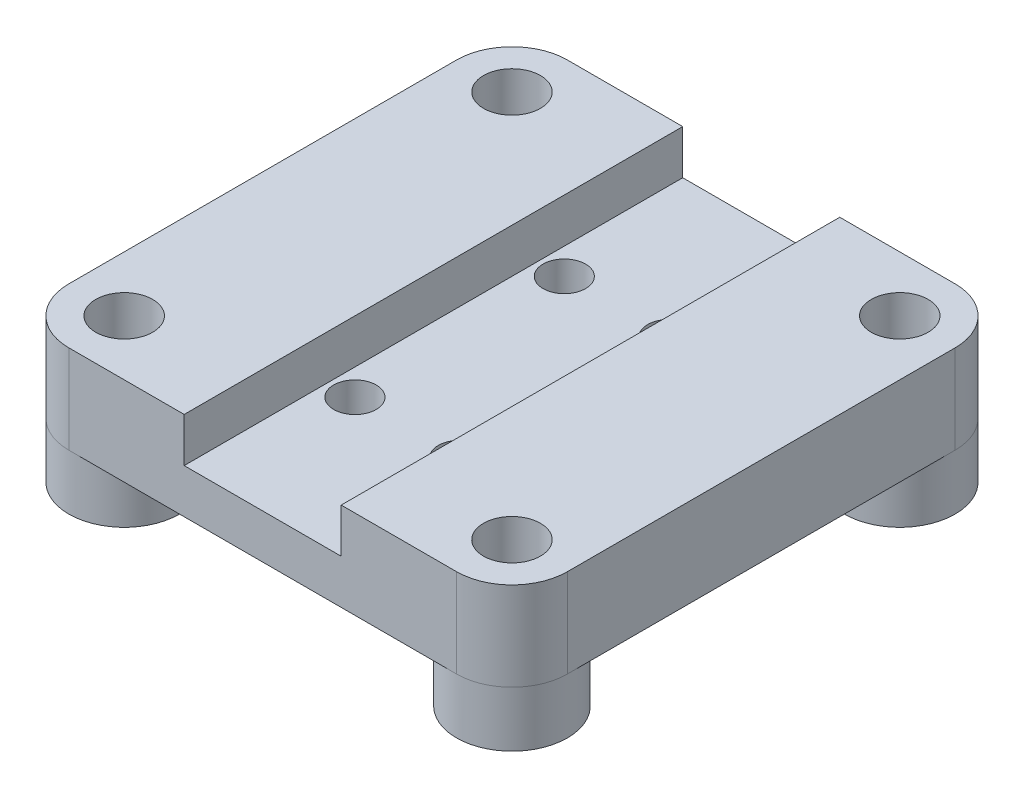
ISO-10303-21;
HEADER;
FILE_DESCRIPTION(('STEP AP214'),'2;1');
FILE_NAME('part.step','',(''),(''),'','','');
FILE_SCHEMA(('AUTOMOTIVE_DESIGN { 1 0 10303 214 1 1 1 1 }'));
ENDSEC;
DATA;
#1=APPLICATION_CONTEXT('core data for automotive mechanical design processes');
#2=APPLICATION_PROTOCOL_DEFINITION('international standard','automotive_design',2000,#1);
#3=PRODUCT_CONTEXT('',#1,'mechanical');
#4=PRODUCT('Part','Part','',(#3));
#5=PRODUCT_RELATED_PRODUCT_CATEGORY('part','',(#4));
#6=PRODUCT_DEFINITION_FORMATION('','',#4);
#7=PRODUCT_DEFINITION_CONTEXT('part definition',#1,'design');
#8=PRODUCT_DEFINITION('design','',#6,#7);
#9=PRODUCT_DEFINITION_SHAPE('','',#8);
#10=(LENGTH_UNIT() NAMED_UNIT(*) SI_UNIT(.MILLI.,.METRE.));
#11=(NAMED_UNIT(*) PLANE_ANGLE_UNIT() SI_UNIT($,.RADIAN.));
#12=(NAMED_UNIT(*) SI_UNIT($,.STERADIAN.) SOLID_ANGLE_UNIT());
#13=UNCERTAINTY_MEASURE_WITH_UNIT(LENGTH_MEASURE(1.E-05),#10,'distance_accuracy_value','');
#14=(GEOMETRIC_REPRESENTATION_CONTEXT(3) GLOBAL_UNCERTAINTY_ASSIGNED_CONTEXT((#13)) GLOBAL_UNIT_ASSIGNED_CONTEXT((#10,
#11,#12)) REPRESENTATION_CONTEXT('',''));
#15=CARTESIAN_POINT('',(0.,0.,0.));
#16=DIRECTION('',(0.,0.,1.));
#17=DIRECTION('',(1.,0.,0.));
#18=AXIS2_PLACEMENT_3D('',#15,#16,#17);
#19=CARTESIAN_POINT('',(14.2875,0.,14.2875));
#20=DIRECTION('',(0.,1.,0.));
#21=DIRECTION('',(-1.,0.,0.));
#22=AXIS2_PLACEMENT_3D('',#19,#20,#21);
#23=PLANE('',#22);
#24=CARTESIAN_POINT('',(-2.999999969,0.,-5.999999938));
#25=DIRECTION('',(0.,1.,0.));
#26=DIRECTION('',(-1.,0.,0.));
#27=AXIS2_PLACEMENT_3D('',#24,#25,#26);
#28=CIRCLE('',#27,1.2192);
#29=CARTESIAN_POINT('',(-4.219199969,0.,-5.999999938));
#30=VERTEX_POINT('',#29);
#31=EDGE_CURVE('E282',#30,#30,#28,.T.);
#32=ORIENTED_EDGE('',*,*,#31,.T.);
#33=EDGE_LOOP('',(#32));
#34=FACE_BOUND('',#33,.T.);
#35=CARTESIAN_POINT('',(2.999999969,0.,5.999999938));
#36=DIRECTION('',(0.,1.,0.));
#37=DIRECTION('',(-1.,0.,0.));
#38=AXIS2_PLACEMENT_3D('',#35,#36,#37);
#39=CIRCLE('',#38,1.2192);
#40=CARTESIAN_POINT('',(1.780799969,0.,5.999999938));
#41=VERTEX_POINT('',#40);
#42=EDGE_CURVE('E37',#41,#41,#39,.T.);
#43=ORIENTED_EDGE('',*,*,#42,.T.);
#44=EDGE_LOOP('',(#43));
#45=FACE_BOUND('',#44,.T.);
#46=CARTESIAN_POINT('',(2.999999969,0.,-5.999999938));
#47=DIRECTION('',(0.,1.,0.));
#48=DIRECTION('',(-1.,0.,0.));
#49=AXIS2_PLACEMENT_3D('',#46,#47,#48);
#50=CIRCLE('',#49,1.2192);
#51=CARTESIAN_POINT('',(1.780799969,0.,-5.999999938));
#52=VERTEX_POINT('',#51);
#53=EDGE_CURVE('E266',#52,#52,#50,.T.);
#54=ORIENTED_EDGE('',*,*,#53,.T.);
#55=EDGE_LOOP('',(#54));
#56=FACE_BOUND('',#55,.T.);
#57=CARTESIAN_POINT('',(-2.999999969,0.,5.999999938));
#58=DIRECTION('',(0.,1.,0.));
#59=DIRECTION('',(-1.,0.,0.));
#60=AXIS2_PLACEMENT_3D('',#57,#58,#59);
#61=CIRCLE('',#60,1.2192);
#62=CARTESIAN_POINT('',(-4.219199969,0.,5.999999938));
#63=VERTEX_POINT('',#62);
#64=EDGE_CURVE('E158',#63,#63,#61,.T.);
#65=ORIENTED_EDGE('',*,*,#64,.T.);
#66=EDGE_LOOP('',(#65));
#67=FACE_BOUND('',#66,.T.);
#68=CARTESIAN_POINT('',(-11.1125,0.,-11.1125));
#69=DIRECTION('',(0.,-1.,0.));
#70=DIRECTION('',(1.,0.,0.));
#71=AXIS2_PLACEMENT_3D('',#68,#69,#70);
#72=CIRCLE('',#71,3.175);
#73=CARTESIAN_POINT('',(-11.1125,0.,-14.2875));
#74=VERTEX_POINT('',#73);
#75=CARTESIAN_POINT('',(-14.2875,0.,-11.1125));
#76=VERTEX_POINT('',#75);
#77=EDGE_CURVE('E133',#74,#76,#72,.T.);
#78=ORIENTED_EDGE('',*,*,#77,.F.);
#79=DIRECTION('',(1.,0.,0.));
#80=VECTOR('',#79,1.);
#81=CARTESIAN_POINT('',(14.2875,0.,-14.2875));
#82=LINE('',#81,#80);
#83=CARTESIAN_POINT('',(11.1125,0.,-14.2875));
#84=VERTEX_POINT('',#83);
#85=EDGE_CURVE('E202',#74,#84,#82,.T.);
#86=ORIENTED_EDGE('',*,*,#85,.T.);
#87=CARTESIAN_POINT('',(11.1125,0.,-11.1125));
#88=DIRECTION('',(0.,-1.,0.));
#89=DIRECTION('',(1.,0.,0.));
#90=AXIS2_PLACEMENT_3D('',#87,#88,#89);
#91=CIRCLE('',#90,3.175);
#92=CARTESIAN_POINT('',(14.2875,0.,-11.1125));
#93=VERTEX_POINT('',#92);
#94=EDGE_CURVE('E170',#93,#84,#91,.T.);
#95=ORIENTED_EDGE('',*,*,#94,.F.);
#96=DIRECTION('',(0.,0.,-1.));
#97=VECTOR('',#96,1.);
#98=CARTESIAN_POINT('',(14.2875,0.,14.2875));
#99=LINE('',#98,#97);
#100=CARTESIAN_POINT('',(14.2875,0.,11.1125));
#101=VERTEX_POINT('',#100);
#102=EDGE_CURVE('E243',#101,#93,#99,.T.);
#103=ORIENTED_EDGE('',*,*,#102,.F.);
#104=CARTESIAN_POINT('',(11.1125,0.,11.1125));
#105=DIRECTION('',(0.,-1.,0.));
#106=DIRECTION('',(1.,0.,0.));
#107=AXIS2_PLACEMENT_3D('',#104,#105,#106);
#108=CIRCLE('',#107,3.175);
#109=CARTESIAN_POINT('',(11.1125,0.,14.2875));
#110=VERTEX_POINT('',#109);
#111=EDGE_CURVE('E175',#110,#101,#108,.T.);
#112=ORIENTED_EDGE('',*,*,#111,.F.);
#113=DIRECTION('',(1.,0.,0.));
#114=VECTOR('',#113,1.);
#115=CARTESIAN_POINT('',(14.2875,0.,14.2875));
#116=LINE('',#115,#114);
#117=CARTESIAN_POINT('',(-11.1125,0.,14.2875));
#118=VERTEX_POINT('',#117);
#119=EDGE_CURVE('E203',#118,#110,#116,.T.);
#120=ORIENTED_EDGE('',*,*,#119,.F.);
#121=CARTESIAN_POINT('',(-11.1125,0.,11.1125));
#122=DIRECTION('',(0.,-1.,0.));
#123=DIRECTION('',(1.,0.,0.));
#124=AXIS2_PLACEMENT_3D('',#121,#122,#123);
#125=CIRCLE('',#124,3.175);
#126=CARTESIAN_POINT('',(-14.2875,0.,11.1125));
#127=VERTEX_POINT('',#126);
#128=EDGE_CURVE('E152',#127,#118,#125,.T.);
#129=ORIENTED_EDGE('',*,*,#128,.F.);
#130=DIRECTION('',(0.,0.,-1.));
#131=VECTOR('',#130,1.);
#132=CARTESIAN_POINT('',(-14.2875,0.,14.2875));
#133=LINE('',#132,#131);
#134=EDGE_CURVE('E140',#127,#76,#133,.T.);
#135=ORIENTED_EDGE('',*,*,#134,.T.);
#136=EDGE_LOOP('',(#78,#86,#95,#103,#112,#120,#129,#135));
#137=FACE_BOUND('',#136,.T.);
#138=ADVANCED_FACE('F33',(#34,#45,#56,#67,#137),#23,.F.);
#139=CARTESIAN_POINT('',(14.2875,5.08,14.2875));
#140=DIRECTION('',(-1.,0.,0.));
#141=DIRECTION('',(0.,0.,1.));
#142=AXIS2_PLACEMENT_3D('',#139,#140,#141);
#143=PLANE('',#142);
#144=ORIENTED_EDGE('',*,*,#102,.T.);
#145=DIRECTION('',(0.,1.,0.));
#146=VECTOR('',#145,1.);
#147=CARTESIAN_POINT('',(14.2875,5.08,-11.1125));
#148=LINE('',#147,#146);
#149=CARTESIAN_POINT('',(14.2875,5.08,-11.1125));
#150=VERTEX_POINT('',#149);
#151=EDGE_CURVE('E261',#93,#150,#148,.T.);
#152=ORIENTED_EDGE('',*,*,#151,.T.);
#153=DIRECTION('',(0.,0.,-1.));
#154=VECTOR('',#153,1.);
#155=CARTESIAN_POINT('',(14.2875,5.08,14.2875));
#156=LINE('',#155,#154);
#157=CARTESIAN_POINT('',(14.2875,5.08,11.1125));
#158=VERTEX_POINT('',#157);
#159=EDGE_CURVE('E241',#158,#150,#156,.T.);
#160=ORIENTED_EDGE('',*,*,#159,.F.);
#161=DIRECTION('',(0.,1.,0.));
#162=VECTOR('',#161,1.);
#163=CARTESIAN_POINT('',(14.2875,5.08,11.1125));
#164=LINE('',#163,#162);
#165=EDGE_CURVE('E259',#158,#101,#164,.F.);
#166=ORIENTED_EDGE('',*,*,#165,.T.);
#167=EDGE_LOOP('',(#144,#152,#160,#166));
#168=FACE_BOUND('',#167,.T.);
#169=ADVANCED_FACE('F345',(#168),#143,.F.);
#170=CARTESIAN_POINT('',(4.5,5.08,14.2875));
#171=DIRECTION('',(0.,-1.,0.));
#172=DIRECTION('',(0.,0.,-1.));
#173=AXIS2_PLACEMENT_3D('',#170,#171,#172);
#174=PLANE('',#173);
#175=CARTESIAN_POINT('',(11.1125,5.08,11.1125));
#176=DIRECTION('',(0.,1.,0.));
#177=DIRECTION('',(0.,0.,1.));
#178=AXIS2_PLACEMENT_3D('',#175,#176,#177);
#179=CIRCLE('',#178,1.63195);
#180=CARTESIAN_POINT('',(11.1125,5.08,12.74445));
#181=VERTEX_POINT('',#180);
#182=EDGE_CURVE('E193',#181,#181,#179,.T.);
#183=ORIENTED_EDGE('',*,*,#182,.F.);
#184=EDGE_LOOP('',(#183));
#185=FACE_BOUND('',#184,.T.);
#186=CARTESIAN_POINT('',(11.1125,5.08,-11.1125));
#187=DIRECTION('',(0.,1.,0.));
#188=DIRECTION('',(0.,0.,1.));
#189=AXIS2_PLACEMENT_3D('',#186,#187,#188);
#190=CIRCLE('',#189,1.63195);
#191=CARTESIAN_POINT('',(11.1125,5.08,-9.48055));
#192=VERTEX_POINT('',#191);
#193=EDGE_CURVE('E196',#192,#192,#190,.T.);
#194=ORIENTED_EDGE('',*,*,#193,.F.);
#195=EDGE_LOOP('',(#194));
#196=FACE_BOUND('',#195,.T.);
#197=ORIENTED_EDGE('',*,*,#159,.T.);
#198=CARTESIAN_POINT('',(11.1125,5.08,-11.1125));
#199=DIRECTION('',(0.,-1.,0.));
#200=DIRECTION('',(0.,0.,-1.));
#201=AXIS2_PLACEMENT_3D('',#198,#199,#200);
#202=CIRCLE('',#201,3.175);
#203=CARTESIAN_POINT('',(11.1125,5.08,-14.2875));
#204=VERTEX_POINT('',#203);
#205=EDGE_CURVE('E11',#150,#204,#202,.F.);
#206=ORIENTED_EDGE('',*,*,#205,.T.);
#207=DIRECTION('',(-1.,0.,0.));
#208=VECTOR('',#207,1.);
#209=CARTESIAN_POINT('',(4.5,5.08,-14.2875));
#210=LINE('',#209,#208);
#211=CARTESIAN_POINT('',(4.5,5.08,-14.2875));
#212=VERTEX_POINT('',#211);
#213=EDGE_CURVE('E218',#204,#212,#210,.T.);
#214=ORIENTED_EDGE('',*,*,#213,.T.);
#215=DIRECTION('',(0.,0.,-1.));
#216=VECTOR('',#215,1.);
#217=CARTESIAN_POINT('',(4.5,5.08,14.2875));
#218=LINE('',#217,#216);
#219=CARTESIAN_POINT('',(4.5,5.08,14.2875));
#220=VERTEX_POINT('',#219);
#221=EDGE_CURVE('E238',#220,#212,#218,.T.);
#222=ORIENTED_EDGE('',*,*,#221,.F.);
#223=DIRECTION('',(-1.,0.,0.));
#224=VECTOR('',#223,1.);
#225=CARTESIAN_POINT('',(4.5,5.08,14.2875));
#226=LINE('',#225,#224);
#227=CARTESIAN_POINT('',(11.1125,5.08,14.2875));
#228=VERTEX_POINT('',#227);
#229=EDGE_CURVE('E206',#228,#220,#226,.T.);
#230=ORIENTED_EDGE('',*,*,#229,.F.);
#231=CARTESIAN_POINT('',(11.1125,5.08,11.1125));
#232=DIRECTION('',(0.,-1.,0.));
#233=DIRECTION('',(0.,0.,-1.));
#234=AXIS2_PLACEMENT_3D('',#231,#232,#233);
#235=CIRCLE('',#234,3.175);
#236=EDGE_CURVE('E42',#228,#158,#235,.F.);
#237=ORIENTED_EDGE('',*,*,#236,.T.);
#238=EDGE_LOOP('',(#197,#206,#214,#222,#230,#237));
#239=FACE_BOUND('',#238,.T.);
#240=ADVANCED_FACE('F351',(#185,#196,#239),#174,.F.);
#241=CARTESIAN_POINT('',(4.5,2.54,14.2875));
#242=DIRECTION('',(1.,0.,0.));
#243=DIRECTION('',(0.,0.,-1.));
#244=AXIS2_PLACEMENT_3D('',#241,#242,#243);
#245=PLANE('',#244);
#246=DIRECTION('',(0.,-1.,0.));
#247=VECTOR('',#246,1.);
#248=CARTESIAN_POINT('',(4.5,2.54,-14.2875));
#249=LINE('',#248,#247);
#250=CARTESIAN_POINT('',(4.5,2.54,-14.2875));
#251=VERTEX_POINT('',#250);
#252=EDGE_CURVE('E220',#212,#251,#249,.T.);
#253=ORIENTED_EDGE('',*,*,#252,.T.);
#254=DIRECTION('',(0.,0.,-1.));
#255=VECTOR('',#254,1.);
#256=CARTESIAN_POINT('',(4.5,2.54,14.2875));
#257=LINE('',#256,#255);
#258=CARTESIAN_POINT('',(4.5,2.54,14.2875));
#259=VERTEX_POINT('',#258);
#260=EDGE_CURVE('E235',#259,#251,#257,.T.);
#261=ORIENTED_EDGE('',*,*,#260,.F.);
#262=DIRECTION('',(0.,-1.,0.));
#263=VECTOR('',#262,1.);
#264=CARTESIAN_POINT('',(4.5,2.54,14.2875));
#265=LINE('',#264,#263);
#266=EDGE_CURVE('E209',#220,#259,#265,.T.);
#267=ORIENTED_EDGE('',*,*,#266,.F.);
#268=ORIENTED_EDGE('',*,*,#221,.T.);
#269=EDGE_LOOP('',(#253,#261,#267,#268));
#270=FACE_BOUND('',#269,.T.);
#271=ADVANCED_FACE('F296',(#270),#245,.F.);
#272=CARTESIAN_POINT('',(-4.5,2.54,14.2875));
#273=DIRECTION('',(0.,-1.,0.));
#274=DIRECTION('',(1.,0.,0.));
#275=AXIS2_PLACEMENT_3D('',#272,#273,#274);
#276=PLANE('',#275);
#277=CARTESIAN_POINT('',(-2.999999969,2.54,-5.999999938));
#278=DIRECTION('',(0.,1.,0.));
#279=DIRECTION('',(0.,0.,1.));
#280=AXIS2_PLACEMENT_3D('',#277,#278,#279);
#281=CIRCLE('',#280,1.2192);
#282=CARTESIAN_POINT('',(-2.999999969,2.54,-4.780799938));
#283=VERTEX_POINT('',#282);
#284=EDGE_CURVE('E285',#283,#283,#281,.T.);
#285=ORIENTED_EDGE('',*,*,#284,.F.);
#286=EDGE_LOOP('',(#285));
#287=FACE_BOUND('',#286,.T.);
#288=CARTESIAN_POINT('',(2.999999969,2.54,5.999999938));
#289=DIRECTION('',(0.,1.,0.));
#290=DIRECTION('',(0.,0.,1.));
#291=AXIS2_PLACEMENT_3D('',#288,#289,#290);
#292=CIRCLE('',#291,1.2192);
#293=CARTESIAN_POINT('',(2.999999969,2.54,7.219199938));
#294=VERTEX_POINT('',#293);
#295=EDGE_CURVE('E278',#294,#294,#292,.T.);
#296=ORIENTED_EDGE('',*,*,#295,.F.);
#297=EDGE_LOOP('',(#296));
#298=FACE_BOUND('',#297,.T.);
#299=CARTESIAN_POINT('',(2.999999969,2.54,-5.999999938));
#300=DIRECTION('',(0.,1.,0.));
#301=DIRECTION('',(0.,0.,1.));
#302=AXIS2_PLACEMENT_3D('',#299,#300,#301);
#303=CIRCLE('',#302,1.2192);
#304=CARTESIAN_POINT('',(2.999999969,2.54,-4.780799938));
#305=VERTEX_POINT('',#304);
#306=EDGE_CURVE('E268',#305,#305,#303,.T.);
#307=ORIENTED_EDGE('',*,*,#306,.F.);
#308=EDGE_LOOP('',(#307));
#309=FACE_BOUND('',#308,.T.);
#310=CARTESIAN_POINT('',(-2.999999969,2.54,5.999999938));
#311=DIRECTION('',(0.,1.,0.));
#312=DIRECTION('',(0.,0.,1.));
#313=AXIS2_PLACEMENT_3D('',#310,#311,#312);
#314=CIRCLE('',#313,1.2192);
#315=CARTESIAN_POINT('',(-2.999999969,2.54,7.219199938));
#316=VERTEX_POINT('',#315);
#317=EDGE_CURVE('E265',#316,#316,#314,.T.);
#318=ORIENTED_EDGE('',*,*,#317,.F.);
#319=EDGE_LOOP('',(#318));
#320=FACE_BOUND('',#319,.T.);
#321=DIRECTION('',(-1.,0.,0.));
#322=VECTOR('',#321,1.);
#323=CARTESIAN_POINT('',(-4.5,2.54,-14.2875));
#324=LINE('',#323,#322);
#325=CARTESIAN_POINT('',(-4.5,2.54,-14.2875));
#326=VERTEX_POINT('',#325);
#327=EDGE_CURVE('E222',#251,#326,#324,.T.);
#328=ORIENTED_EDGE('',*,*,#327,.T.);
#329=DIRECTION('',(0.,0.,-1.));
#330=VECTOR('',#329,1.);
#331=CARTESIAN_POINT('',(-4.5,2.54,14.2875));
#332=LINE('',#331,#330);
#333=CARTESIAN_POINT('',(-4.5,2.54,14.2875));
#334=VERTEX_POINT('',#333);
#335=EDGE_CURVE('E232',#334,#326,#332,.T.);
#336=ORIENTED_EDGE('',*,*,#335,.F.);
#337=DIRECTION('',(-1.,0.,0.));
#338=VECTOR('',#337,1.);
#339=CARTESIAN_POINT('',(-4.5,2.54,14.2875));
#340=LINE('',#339,#338);
#341=EDGE_CURVE('E211',#259,#334,#340,.T.);
#342=ORIENTED_EDGE('',*,*,#341,.F.);
#343=ORIENTED_EDGE('',*,*,#260,.T.);
#344=EDGE_LOOP('',(#328,#336,#342,#343));
#345=FACE_BOUND('',#344,.T.);
#346=ADVANCED_FACE('F292',(#287,#298,#309,#320,#345),#276,.F.);
#347=CARTESIAN_POINT('',(-4.5,5.08,14.2875));
#348=DIRECTION('',(-1.,0.,0.));
#349=DIRECTION('',(0.,0.,1.));
#350=AXIS2_PLACEMENT_3D('',#347,#348,#349);
#351=PLANE('',#350);
#352=DIRECTION('',(0.,1.,0.));
#353=VECTOR('',#352,1.);
#354=CARTESIAN_POINT('',(-4.5,5.08,-14.2875));
#355=LINE('',#354,#353);
#356=CARTESIAN_POINT('',(-4.5,5.08,-14.2875));
#357=VERTEX_POINT('',#356);
#358=EDGE_CURVE('E224',#326,#357,#355,.T.);
#359=ORIENTED_EDGE('',*,*,#358,.T.);
#360=DIRECTION('',(0.,0.,-1.));
#361=VECTOR('',#360,1.);
#362=CARTESIAN_POINT('',(-4.5,5.08,14.2875));
#363=LINE('',#362,#361);
#364=CARTESIAN_POINT('',(-4.5,5.08,14.2875));
#365=VERTEX_POINT('',#364);
#366=EDGE_CURVE('E229',#365,#357,#363,.T.);
#367=ORIENTED_EDGE('',*,*,#366,.F.);
#368=DIRECTION('',(0.,1.,0.));
#369=VECTOR('',#368,1.);
#370=CARTESIAN_POINT('',(-4.5,5.08,14.2875));
#371=LINE('',#370,#369);
#372=EDGE_CURVE('E213',#334,#365,#371,.T.);
#373=ORIENTED_EDGE('',*,*,#372,.F.);
#374=ORIENTED_EDGE('',*,*,#335,.T.);
#375=EDGE_LOOP('',(#359,#367,#373,#374));
#376=FACE_BOUND('',#375,.T.);
#377=ADVANCED_FACE('F295',(#376),#351,.F.);
#378=CARTESIAN_POINT('',(-14.2875,5.08,14.2875));
#379=DIRECTION('',(0.,-1.,0.));
#380=DIRECTION('',(1.,0.,0.));
#381=AXIS2_PLACEMENT_3D('',#378,#379,#380);
#382=PLANE('',#381);
#383=CARTESIAN_POINT('',(-11.1125,5.08,-11.1125));
#384=DIRECTION('',(0.,1.,0.));
#385=DIRECTION('',(0.,0.,1.));
#386=AXIS2_PLACEMENT_3D('',#383,#384,#385);
#387=CIRCLE('',#386,1.63195);
#388=CARTESIAN_POINT('',(-11.1125,5.08,-9.48055));
#389=VERTEX_POINT('',#388);
#390=EDGE_CURVE('E189',#389,#389,#387,.T.);
#391=ORIENTED_EDGE('',*,*,#390,.F.);
#392=EDGE_LOOP('',(#391));
#393=FACE_BOUND('',#392,.T.);
#394=CARTESIAN_POINT('',(-11.1125,5.08,11.1125));
#395=DIRECTION('',(0.,1.,0.));
#396=DIRECTION('',(0.,0.,1.));
#397=AXIS2_PLACEMENT_3D('',#394,#395,#396);
#398=CIRCLE('',#397,1.63195);
#399=CARTESIAN_POINT('',(-11.1125,5.08,12.74445));
#400=VERTEX_POINT('',#399);
#401=EDGE_CURVE('E199',#400,#400,#398,.T.);
#402=ORIENTED_EDGE('',*,*,#401,.F.);
#403=EDGE_LOOP('',(#402));
#404=FACE_BOUND('',#403,.T.);
#405=DIRECTION('',(-1.,0.,0.));
#406=VECTOR('',#405,1.);
#407=CARTESIAN_POINT('',(-14.2875,5.08,-14.2875));
#408=LINE('',#407,#406);
#409=CARTESIAN_POINT('',(-11.1125,5.08,-14.2875));
#410=VERTEX_POINT('',#409);
#411=EDGE_CURVE('E207',#357,#410,#408,.T.);
#412=ORIENTED_EDGE('',*,*,#411,.T.);
#413=CARTESIAN_POINT('',(-11.1125,5.08,-11.1125));
#414=DIRECTION('',(0.,-1.,0.));
#415=DIRECTION('',(1.,0.,0.));
#416=AXIS2_PLACEMENT_3D('',#413,#414,#415);
#417=CIRCLE('',#416,3.175);
#418=CARTESIAN_POINT('',(-14.2875,5.08,-11.1125));
#419=VERTEX_POINT('',#418);
#420=EDGE_CURVE('E251',#410,#419,#417,.F.);
#421=ORIENTED_EDGE('',*,*,#420,.T.);
#422=DIRECTION('',(0.,0.,-1.));
#423=VECTOR('',#422,1.);
#424=CARTESIAN_POINT('',(-14.2875,5.08,14.2875));
#425=LINE('',#424,#423);
#426=CARTESIAN_POINT('',(-14.2875,5.08,11.1125));
#427=VERTEX_POINT('',#426);
#428=EDGE_CURVE('E143',#427,#419,#425,.T.);
#429=ORIENTED_EDGE('',*,*,#428,.F.);
#430=CARTESIAN_POINT('',(-11.1125,5.08,11.1125));
#431=DIRECTION('',(0.,-1.,0.));
#432=DIRECTION('',(1.,0.,0.));
#433=AXIS2_PLACEMENT_3D('',#430,#431,#432);
#434=CIRCLE('',#433,3.175);
#435=CARTESIAN_POINT('',(-11.1125,5.08,14.2875));
#436=VERTEX_POINT('',#435);
#437=EDGE_CURVE('E249',#427,#436,#434,.F.);
#438=ORIENTED_EDGE('',*,*,#437,.T.);
#439=DIRECTION('',(-1.,0.,0.));
#440=VECTOR('',#439,1.);
#441=CARTESIAN_POINT('',(-14.2875,5.08,14.2875));
#442=LINE('',#441,#440);
#443=EDGE_CURVE('E153',#365,#436,#442,.T.);
#444=ORIENTED_EDGE('',*,*,#443,.F.);
#445=ORIENTED_EDGE('',*,*,#366,.T.);
#446=EDGE_LOOP('',(#412,#421,#429,#438,#444,#445));
#447=FACE_BOUND('',#446,.T.);
#448=ADVANCED_FACE('F316',(#393,#404,#447),#382,.F.);
#449=CARTESIAN_POINT('',(-14.2875,0.,14.2875));
#450=DIRECTION('',(1.,0.,0.));
#451=DIRECTION('',(0.,1.,0.));
#452=AXIS2_PLACEMENT_3D('',#449,#450,#451);
#453=PLANE('',#452);
#454=ORIENTED_EDGE('',*,*,#428,.T.);
#455=DIRECTION('',(0.,-1.,0.));
#456=VECTOR('',#455,1.);
#457=CARTESIAN_POINT('',(-14.2875,0.,-11.1125));
#458=LINE('',#457,#456);
#459=EDGE_CURVE('E128',#419,#76,#458,.T.);
#460=ORIENTED_EDGE('',*,*,#459,.T.);
#461=ORIENTED_EDGE('',*,*,#134,.F.);
#462=DIRECTION('',(0.,-1.,0.));
#463=VECTOR('',#462,1.);
#464=CARTESIAN_POINT('',(-14.2875,0.,11.1125));
#465=LINE('',#464,#463);
#466=EDGE_CURVE('E145',#127,#427,#465,.F.);
#467=ORIENTED_EDGE('',*,*,#466,.T.);
#468=EDGE_LOOP('',(#454,#460,#461,#467));
#469=FACE_BOUND('',#468,.T.);
#470=ADVANCED_FACE('F139',(#469),#453,.F.);
#471=CARTESIAN_POINT('',(0.,0.,14.2875));
#472=DIRECTION('',(0.,0.,-1.));
#473=DIRECTION('',(-1.,0.,0.));
#474=AXIS2_PLACEMENT_3D('',#471,#472,#473);
#475=PLANE('',#474);
#476=ORIENTED_EDGE('',*,*,#443,.T.);
#477=DIRECTION('',(0.,-1.,0.));
#478=VECTOR('',#477,1.);
#479=CARTESIAN_POINT('',(-11.1125,0.,14.2875));
#480=LINE('',#479,#478);
#481=EDGE_CURVE('E256',#436,#118,#480,.T.);
#482=ORIENTED_EDGE('',*,*,#481,.T.);
#483=ORIENTED_EDGE('',*,*,#119,.T.);
#484=DIRECTION('',(0.,1.,0.));
#485=VECTOR('',#484,1.);
#486=CARTESIAN_POINT('',(11.1125,0.,14.2875));
#487=LINE('',#486,#485);
#488=EDGE_CURVE('E253',#110,#228,#487,.T.);
#489=ORIENTED_EDGE('',*,*,#488,.T.);
#490=ORIENTED_EDGE('',*,*,#229,.T.);
#491=ORIENTED_EDGE('',*,*,#266,.T.);
#492=ORIENTED_EDGE('',*,*,#341,.T.);
#493=ORIENTED_EDGE('',*,*,#372,.T.);
#494=EDGE_LOOP('',(#476,#482,#483,#489,#490,#491,#492,#493));
#495=FACE_BOUND('',#494,.T.);
#496=ADVANCED_FACE('F321',(#495),#475,.F.);
#497=CARTESIAN_POINT('',(0.,0.,-14.2875));
#498=DIRECTION('',(0.,0.,-1.));
#499=DIRECTION('',(-1.,0.,0.));
#500=AXIS2_PLACEMENT_3D('',#497,#498,#499);
#501=PLANE('',#500);
#502=ORIENTED_EDGE('',*,*,#85,.F.);
#503=DIRECTION('',(0.,-1.,0.));
#504=VECTOR('',#503,1.);
#505=CARTESIAN_POINT('',(-11.1125,5.08000000000001,-14.2875));
#506=LINE('',#505,#504);
#507=EDGE_CURVE('E129',#74,#410,#506,.F.);
#508=ORIENTED_EDGE('',*,*,#507,.T.);
#509=ORIENTED_EDGE('',*,*,#411,.F.);
#510=ORIENTED_EDGE('',*,*,#358,.F.);
#511=ORIENTED_EDGE('',*,*,#327,.F.);
#512=ORIENTED_EDGE('',*,*,#252,.F.);
#513=ORIENTED_EDGE('',*,*,#213,.F.);
#514=DIRECTION('',(0.,1.,0.));
#515=VECTOR('',#514,1.);
#516=CARTESIAN_POINT('',(11.1125,0.,-14.2875));
#517=LINE('',#516,#515);
#518=EDGE_CURVE('E144',#204,#84,#517,.F.);
#519=ORIENTED_EDGE('',*,*,#518,.T.);
#520=EDGE_LOOP('',(#502,#508,#509,#510,#511,#512,#513,#519));
#521=FACE_BOUND('',#520,.T.);
#522=ADVANCED_FACE('F314',(#521),#501,.T.);
#523=CARTESIAN_POINT('',(-11.1125,5.08,11.1125));
#524=DIRECTION('',(0.,1.,0.));
#525=DIRECTION('',(0.,0.,1.));
#526=AXIS2_PLACEMENT_3D('',#523,#524,#525);
#527=CYLINDRICAL_SURFACE('',#526,1.63195);
#528=ORIENTED_EDGE('',*,*,#401,.T.);
#529=EDGE_LOOP('',(#528));
#530=FACE_BOUND('',#529,.T.);
#531=CARTESIAN_POINT('',(-11.1125,-3.175,11.1125));
#532=DIRECTION('',(0.,-1.,0.));
#533=DIRECTION('',(1.,0.,0.));
#534=AXIS2_PLACEMENT_3D('',#531,#532,#533);
#535=CIRCLE('',#534,1.63195);
#536=CARTESIAN_POINT('',(-9.48055,-3.175,11.1125));
#537=VERTEX_POINT('',#536);
#538=EDGE_CURVE('E179',#537,#537,#535,.T.);
#539=ORIENTED_EDGE('',*,*,#538,.T.);
#540=EDGE_LOOP('',(#539));
#541=FACE_BOUND('',#540,.T.);
#542=ADVANCED_FACE('F397',(#530,#541),#527,.F.);
#543=CARTESIAN_POINT('',(11.1125,5.08,-11.1125));
#544=DIRECTION('',(0.,1.,0.));
#545=DIRECTION('',(0.,0.,1.));
#546=AXIS2_PLACEMENT_3D('',#543,#544,#545);
#547=CYLINDRICAL_SURFACE('',#546,1.63195);
#548=ORIENTED_EDGE('',*,*,#193,.T.);
#549=EDGE_LOOP('',(#548));
#550=FACE_BOUND('',#549,.T.);
#551=CARTESIAN_POINT('',(11.1125,-3.175,-11.1125));
#552=DIRECTION('',(0.,-1.,0.));
#553=DIRECTION('',(1.,0.,0.));
#554=AXIS2_PLACEMENT_3D('',#551,#552,#553);
#555=CIRCLE('',#554,1.63195);
#556=CARTESIAN_POINT('',(12.74445,-3.175,-11.1125));
#557=VERTEX_POINT('',#556);
#558=EDGE_CURVE('E162',#557,#557,#555,.T.);
#559=ORIENTED_EDGE('',*,*,#558,.T.);
#560=EDGE_LOOP('',(#559));
#561=FACE_BOUND('',#560,.T.);
#562=ADVANCED_FACE('F402',(#550,#561),#547,.F.);
#563=CARTESIAN_POINT('',(11.1125,5.08,11.1125));
#564=DIRECTION('',(0.,1.,0.));
#565=DIRECTION('',(0.,0.,1.));
#566=AXIS2_PLACEMENT_3D('',#563,#564,#565);
#567=CYLINDRICAL_SURFACE('',#566,1.63195);
#568=ORIENTED_EDGE('',*,*,#182,.T.);
#569=EDGE_LOOP('',(#568));
#570=FACE_BOUND('',#569,.T.);
#571=CARTESIAN_POINT('',(11.1125,-3.175,11.1125));
#572=DIRECTION('',(0.,-1.,0.));
#573=DIRECTION('',(1.,0.,0.));
#574=AXIS2_PLACEMENT_3D('',#571,#572,#573);
#575=CIRCLE('',#574,1.63195);
#576=CARTESIAN_POINT('',(12.74445,-3.175,11.1125));
#577=VERTEX_POINT('',#576);
#578=EDGE_CURVE('E169',#577,#577,#575,.T.);
#579=ORIENTED_EDGE('',*,*,#578,.T.);
#580=EDGE_LOOP('',(#579));
#581=FACE_BOUND('',#580,.T.);
#582=ADVANCED_FACE('F406',(#570,#581),#567,.F.);
#583=CARTESIAN_POINT('',(-11.1125,5.08,-11.1125));
#584=DIRECTION('',(0.,1.,0.));
#585=DIRECTION('',(0.,0.,1.));
#586=AXIS2_PLACEMENT_3D('',#583,#584,#585);
#587=CYLINDRICAL_SURFACE('',#586,1.63195);
#588=ORIENTED_EDGE('',*,*,#390,.T.);
#589=EDGE_LOOP('',(#588));
#590=FACE_BOUND('',#589,.T.);
#591=CARTESIAN_POINT('',(-11.1125,-3.175,-11.1125));
#592=DIRECTION('',(0.,-1.,0.));
#593=DIRECTION('',(1.,0.,0.));
#594=AXIS2_PLACEMENT_3D('',#591,#592,#593);
#595=CIRCLE('',#594,1.63195);
#596=CARTESIAN_POINT('',(-9.48055,-3.175,-11.1125));
#597=VERTEX_POINT('',#596);
#598=EDGE_CURVE('E156',#597,#597,#595,.T.);
#599=ORIENTED_EDGE('',*,*,#598,.T.);
#600=EDGE_LOOP('',(#599));
#601=FACE_BOUND('',#600,.T.);
#602=ADVANCED_FACE('F339',(#590,#601),#587,.F.);
#603=CARTESIAN_POINT('',(-11.1125,-3.175,11.1125));
#604=DIRECTION('',(0.,-1.,0.));
#605=DIRECTION('',(1.,0.,0.));
#606=AXIS2_PLACEMENT_3D('',#603,#604,#605);
#607=PLANE('',#606);
#608=CARTESIAN_POINT('',(-11.1125,-3.175,11.1125));
#609=DIRECTION('',(0.,-1.,0.));
#610=DIRECTION('',(1.,0.,0.));
#611=AXIS2_PLACEMENT_3D('',#608,#609,#610);
#612=CIRCLE('',#611,3.175);
#613=CARTESIAN_POINT('',(-7.9375,-3.175,11.1125));
#614=VERTEX_POINT('',#613);
#615=EDGE_CURVE('E186',#614,#614,#612,.T.);
#616=ORIENTED_EDGE('',*,*,#615,.T.);
#617=EDGE_LOOP('',(#616));
#618=FACE_BOUND('',#617,.T.);
#619=ORIENTED_EDGE('',*,*,#538,.F.);
#620=EDGE_LOOP('',(#619));
#621=FACE_BOUND('',#620,.T.);
#622=ADVANCED_FACE('F329',(#618,#621),#607,.T.);
#623=CARTESIAN_POINT('',(-11.1125,-3.175,11.1125));
#624=DIRECTION('',(0.,1.,0.));
#625=DIRECTION('',(-1.,0.,0.));
#626=AXIS2_PLACEMENT_3D('',#623,#624,#625);
#627=CYLINDRICAL_SURFACE('',#626,3.175);
#628=ORIENTED_EDGE('',*,*,#615,.F.);
#629=EDGE_LOOP('',(#628));
#630=FACE_BOUND('',#629,.T.);
#631=EDGE_CURVE('E185',#118,#127,#125,.T.);
#632=ORIENTED_EDGE('',*,*,#631,.T.);
#633=ORIENTED_EDGE('',*,*,#128,.T.);
#634=EDGE_LOOP('',(#632,#633));
#635=FACE_BOUND('',#634,.T.);
#636=ADVANCED_FACE('F326',(#630,#635),#627,.T.);
#637=CARTESIAN_POINT('',(11.1125,-3.175,11.1125));
#638=DIRECTION('',(0.,-1.,0.));
#639=DIRECTION('',(1.,0.,0.));
#640=AXIS2_PLACEMENT_3D('',#637,#638,#639);
#641=PLANE('',#640);
#642=CARTESIAN_POINT('',(11.1125,-3.175,11.1125));
#643=DIRECTION('',(0.,-1.,0.));
#644=DIRECTION('',(1.,0.,0.));
#645=AXIS2_PLACEMENT_3D('',#642,#643,#644);
#646=CIRCLE('',#645,3.175);
#647=CARTESIAN_POINT('',(14.2875,-3.175,11.1125));
#648=VERTEX_POINT('',#647);
#649=EDGE_CURVE('E176',#648,#648,#646,.T.);
#650=ORIENTED_EDGE('',*,*,#649,.T.);
#651=EDGE_LOOP('',(#650));
#652=FACE_BOUND('',#651,.T.);
#653=ORIENTED_EDGE('',*,*,#578,.F.);
#654=EDGE_LOOP('',(#653));
#655=FACE_BOUND('',#654,.T.);
#656=ADVANCED_FACE('F328',(#652,#655),#641,.T.);
#657=CARTESIAN_POINT('',(11.1125,-3.175,11.1125));
#658=DIRECTION('',(0.,1.,0.));
#659=DIRECTION('',(-1.,0.,0.));
#660=AXIS2_PLACEMENT_3D('',#657,#658,#659);
#661=CYLINDRICAL_SURFACE('',#660,3.175);
#662=ORIENTED_EDGE('',*,*,#649,.F.);
#663=EDGE_LOOP('',(#662));
#664=FACE_BOUND('',#663,.T.);
#665=EDGE_CURVE('E180',#101,#110,#108,.T.);
#666=ORIENTED_EDGE('',*,*,#665,.T.);
#667=ORIENTED_EDGE('',*,*,#111,.T.);
#668=EDGE_LOOP('',(#666,#667));
#669=FACE_BOUND('',#668,.T.);
#670=ADVANCED_FACE('F336',(#664,#669),#661,.T.);
#671=CARTESIAN_POINT('',(11.1125,-3.175,-11.1125));
#672=DIRECTION('',(0.,-1.,0.));
#673=DIRECTION('',(1.,0.,0.));
#674=AXIS2_PLACEMENT_3D('',#671,#672,#673);
#675=PLANE('',#674);
#676=CARTESIAN_POINT('',(11.1125,-3.175,-11.1125));
#677=DIRECTION('',(0.,-1.,0.));
#678=DIRECTION('',(1.,0.,0.));
#679=AXIS2_PLACEMENT_3D('',#676,#677,#678);
#680=CIRCLE('',#679,3.175);
#681=CARTESIAN_POINT('',(14.2875,-3.175,-11.1125));
#682=VERTEX_POINT('',#681);
#683=EDGE_CURVE('E166',#682,#682,#680,.T.);
#684=ORIENTED_EDGE('',*,*,#683,.T.);
#685=EDGE_LOOP('',(#684));
#686=FACE_BOUND('',#685,.T.);
#687=ORIENTED_EDGE('',*,*,#558,.F.);
#688=EDGE_LOOP('',(#687));
#689=FACE_BOUND('',#688,.T.);
#690=ADVANCED_FACE('F428',(#686,#689),#675,.T.);
#691=CARTESIAN_POINT('',(11.1125,-3.175,-11.1125));
#692=DIRECTION('',(0.,1.,0.));
#693=DIRECTION('',(-1.,0.,0.));
#694=AXIS2_PLACEMENT_3D('',#691,#692,#693);
#695=CYLINDRICAL_SURFACE('',#694,3.175);
#696=ORIENTED_EDGE('',*,*,#683,.F.);
#697=EDGE_LOOP('',(#696));
#698=FACE_BOUND('',#697,.T.);
#699=ORIENTED_EDGE('',*,*,#94,.T.);
#700=EDGE_CURVE('E165',#84,#93,#91,.T.);
#701=ORIENTED_EDGE('',*,*,#700,.T.);
#702=EDGE_LOOP('',(#699,#701));
#703=FACE_BOUND('',#702,.T.);
#704=ADVANCED_FACE('F370',(#698,#703),#695,.T.);
#705=CARTESIAN_POINT('',(-11.1125,-3.175,-11.1125));
#706=DIRECTION('',(0.,-1.,0.));
#707=DIRECTION('',(1.,0.,0.));
#708=AXIS2_PLACEMENT_3D('',#705,#706,#707);
#709=PLANE('',#708);
#710=CARTESIAN_POINT('',(-11.1125,-3.175,-11.1125));
#711=DIRECTION('',(0.,-1.,0.));
#712=DIRECTION('',(1.,0.,0.));
#713=AXIS2_PLACEMENT_3D('',#710,#711,#712);
#714=CIRCLE('',#713,3.175);
#715=CARTESIAN_POINT('',(-7.9375,-3.175,-11.1125));
#716=VERTEX_POINT('',#715);
#717=EDGE_CURVE('E132',#716,#716,#714,.T.);
#718=ORIENTED_EDGE('',*,*,#717,.T.);
#719=EDGE_LOOP('',(#718));
#720=FACE_BOUND('',#719,.T.);
#721=ORIENTED_EDGE('',*,*,#598,.F.);
#722=EDGE_LOOP('',(#721));
#723=FACE_BOUND('',#722,.T.);
#724=ADVANCED_FACE('F418',(#720,#723),#709,.T.);
#725=CARTESIAN_POINT('',(-11.1125,-3.175,-11.1125));
#726=DIRECTION('',(0.,1.,0.));
#727=DIRECTION('',(-1.,0.,0.));
#728=AXIS2_PLACEMENT_3D('',#725,#726,#727);
#729=CYLINDRICAL_SURFACE('',#728,3.175);
#730=ORIENTED_EDGE('',*,*,#717,.F.);
#731=EDGE_LOOP('',(#730));
#732=FACE_BOUND('',#731,.T.);
#733=EDGE_CURVE('E124',#76,#74,#72,.T.);
#734=ORIENTED_EDGE('',*,*,#733,.T.);
#735=ORIENTED_EDGE('',*,*,#77,.T.);
#736=EDGE_LOOP('',(#734,#735));
#737=FACE_BOUND('',#736,.T.);
#738=ADVANCED_FACE('F155',(#732,#737),#729,.T.);
#739=CARTESIAN_POINT('',(-11.1125,0.,-11.1125));
#740=DIRECTION('',(0.,1.,0.));
#741=DIRECTION('',(-1.,0.,0.));
#742=AXIS2_PLACEMENT_3D('',#739,#740,#741);
#743=CYLINDRICAL_SURFACE('',#742,3.175);
#744=ORIENTED_EDGE('',*,*,#420,.F.);
#745=ORIENTED_EDGE('',*,*,#507,.F.);
#746=ORIENTED_EDGE('',*,*,#733,.F.);
#747=ORIENTED_EDGE('',*,*,#459,.F.);
#748=EDGE_LOOP('',(#744,#745,#746,#747));
#749=FACE_BOUND('',#748,.T.);
#750=ADVANCED_FACE('F127',(#749),#743,.T.);
#751=CARTESIAN_POINT('',(-11.1125,0.,11.1125));
#752=DIRECTION('',(0.,-1.,0.));
#753=DIRECTION('',(1.,0.,0.));
#754=AXIS2_PLACEMENT_3D('',#751,#752,#753);
#755=CYLINDRICAL_SURFACE('',#754,3.175);
#756=ORIENTED_EDGE('',*,*,#437,.F.);
#757=ORIENTED_EDGE('',*,*,#466,.F.);
#758=ORIENTED_EDGE('',*,*,#631,.F.);
#759=ORIENTED_EDGE('',*,*,#481,.F.);
#760=EDGE_LOOP('',(#756,#757,#758,#759));
#761=FACE_BOUND('',#760,.T.);
#762=ADVANCED_FACE('F323',(#761),#755,.T.);
#763=CARTESIAN_POINT('',(11.1125,5.08,-11.1125));
#764=DIRECTION('',(0.,-1.,0.));
#765=DIRECTION('',(0.,0.,-1.));
#766=AXIS2_PLACEMENT_3D('',#763,#764,#765);
#767=CYLINDRICAL_SURFACE('',#766,3.175);
#768=ORIENTED_EDGE('',*,*,#700,.F.);
#769=ORIENTED_EDGE('',*,*,#518,.F.);
#770=ORIENTED_EDGE('',*,*,#205,.F.);
#771=ORIENTED_EDGE('',*,*,#151,.F.);
#772=EDGE_LOOP('',(#768,#769,#770,#771));
#773=FACE_BOUND('',#772,.T.);
#774=ADVANCED_FACE('F360',(#773),#767,.T.);
#775=CARTESIAN_POINT('',(11.1125,0.,11.1125));
#776=DIRECTION('',(0.,1.,0.));
#777=DIRECTION('',(0.,0.,1.));
#778=AXIS2_PLACEMENT_3D('',#775,#776,#777);
#779=CYLINDRICAL_SURFACE('',#778,3.175);
#780=ORIENTED_EDGE('',*,*,#665,.F.);
#781=ORIENTED_EDGE('',*,*,#165,.F.);
#782=ORIENTED_EDGE('',*,*,#236,.F.);
#783=ORIENTED_EDGE('',*,*,#488,.F.);
#784=EDGE_LOOP('',(#780,#781,#782,#783));
#785=FACE_BOUND('',#784,.T.);
#786=ADVANCED_FACE('F35',(#785),#779,.T.);
#787=CARTESIAN_POINT('',(-2.999999969,2.54,5.999999938));
#788=DIRECTION('',(0.,1.,0.));
#789=DIRECTION('',(0.,0.,1.));
#790=AXIS2_PLACEMENT_3D('',#787,#788,#789);
#791=CYLINDRICAL_SURFACE('',#790,1.2192);
#792=ORIENTED_EDGE('',*,*,#317,.T.);
#793=EDGE_LOOP('',(#792));
#794=FACE_BOUND('',#793,.T.);
#795=ORIENTED_EDGE('',*,*,#64,.F.);
#796=EDGE_LOOP('',(#795));
#797=FACE_BOUND('',#796,.T.);
#798=ADVANCED_FACE('F365',(#794,#797),#791,.F.);
#799=CARTESIAN_POINT('',(2.999999969,2.54,-5.999999938));
#800=DIRECTION('',(0.,1.,0.));
#801=DIRECTION('',(0.,0.,1.));
#802=AXIS2_PLACEMENT_3D('',#799,#800,#801);
#803=CYLINDRICAL_SURFACE('',#802,1.2192);
#804=ORIENTED_EDGE('',*,*,#306,.T.);
#805=EDGE_LOOP('',(#804));
#806=FACE_BOUND('',#805,.T.);
#807=ORIENTED_EDGE('',*,*,#53,.F.);
#808=EDGE_LOOP('',(#807));
#809=FACE_BOUND('',#808,.T.);
#810=ADVANCED_FACE('F508',(#806,#809),#803,.F.);
#811=CARTESIAN_POINT('',(2.999999969,2.54,5.999999938));
#812=DIRECTION('',(0.,1.,0.));
#813=DIRECTION('',(0.,0.,1.));
#814=AXIS2_PLACEMENT_3D('',#811,#812,#813);
#815=CYLINDRICAL_SURFACE('',#814,1.2192);
#816=ORIENTED_EDGE('',*,*,#295,.T.);
#817=EDGE_LOOP('',(#816));
#818=FACE_BOUND('',#817,.T.);
#819=ORIENTED_EDGE('',*,*,#42,.F.);
#820=EDGE_LOOP('',(#819));
#821=FACE_BOUND('',#820,.T.);
#822=ADVANCED_FACE('F517',(#818,#821),#815,.F.);
#823=CARTESIAN_POINT('',(-2.999999969,2.54,-5.999999938));
#824=DIRECTION('',(0.,1.,0.));
#825=DIRECTION('',(0.,0.,1.));
#826=AXIS2_PLACEMENT_3D('',#823,#824,#825);
#827=CYLINDRICAL_SURFACE('',#826,1.2192);
#828=ORIENTED_EDGE('',*,*,#284,.T.);
#829=EDGE_LOOP('',(#828));
#830=FACE_BOUND('',#829,.T.);
#831=ORIENTED_EDGE('',*,*,#31,.F.);
#832=EDGE_LOOP('',(#831));
#833=FACE_BOUND('',#832,.T.);
#834=ADVANCED_FACE('F289',(#830,#833),#827,.F.);
#835=CLOSED_SHELL('',(#138,#169,#240,#271,#346,#377,#448,#470,#496,#522,#542,#562,#582,#602,
#622,#636,#656,#670,#690,#704,#724,#738,#750,#762,#774,#786,#798,#810,#822,#834));
#836=MANIFOLD_SOLID_BREP('B2',#835);
#837=ADVANCED_BREP_SHAPE_REPRESENTATION('',(#18,#836),#14);
#838=SHAPE_DEFINITION_REPRESENTATION(#9,#837);
ENDSEC;
END-ISO-10303-21;
